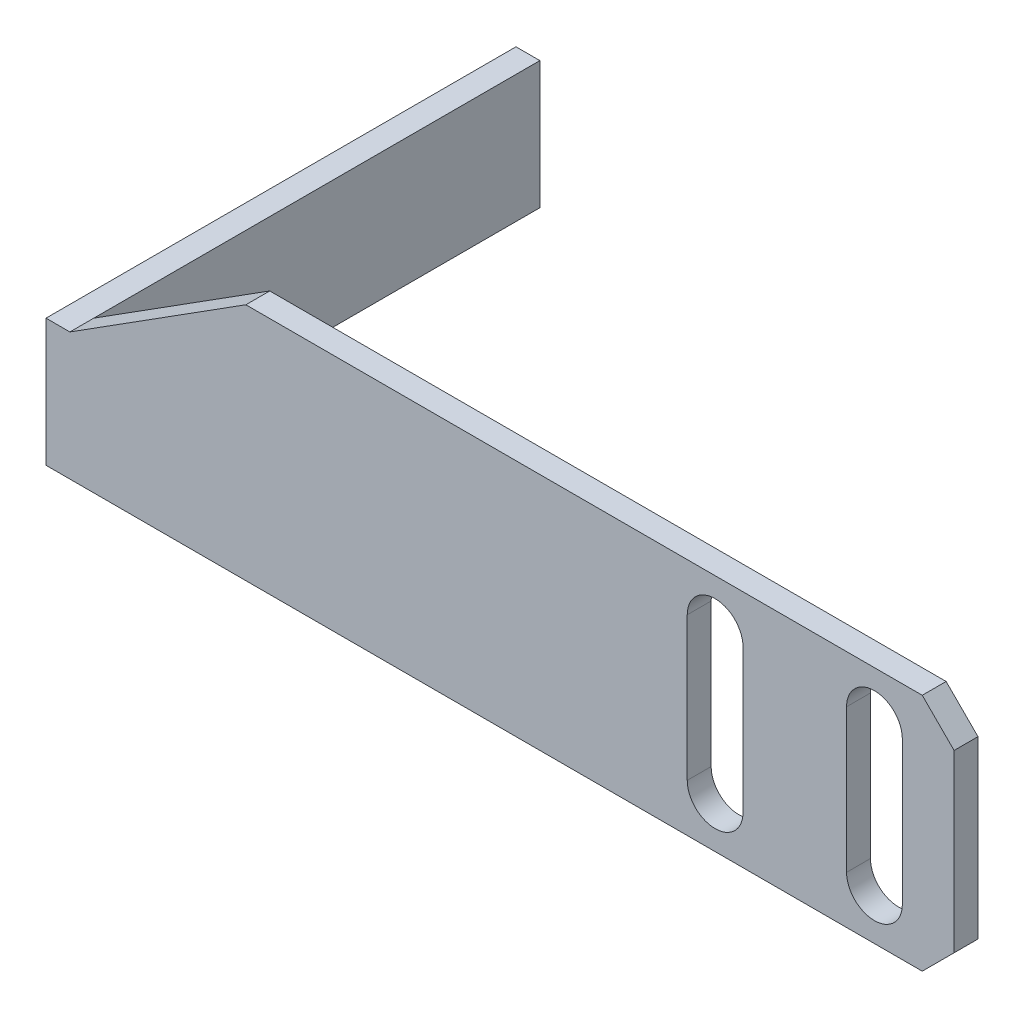
ISO-10303-21;
HEADER;
FILE_DESCRIPTION(('STEP AP214'),'2;1');
FILE_NAME('part.step','',(''),(''),'','','');
FILE_SCHEMA(('AUTOMOTIVE_DESIGN { 1 0 10303 214 1 1 1 1 }'));
ENDSEC;
DATA;
#1=APPLICATION_CONTEXT('core data for automotive mechanical design processes');
#2=APPLICATION_PROTOCOL_DEFINITION('international standard','automotive_design',2000,#1);
#3=PRODUCT_CONTEXT('',#1,'mechanical');
#4=PRODUCT('Part','Part','',(#3));
#5=PRODUCT_RELATED_PRODUCT_CATEGORY('part','',(#4));
#6=PRODUCT_DEFINITION_FORMATION('','',#4);
#7=PRODUCT_DEFINITION_CONTEXT('part definition',#1,'design');
#8=PRODUCT_DEFINITION('design','',#6,#7);
#9=PRODUCT_DEFINITION_SHAPE('','',#8);
#10=(LENGTH_UNIT() NAMED_UNIT(*) SI_UNIT(.MILLI.,.METRE.));
#11=(NAMED_UNIT(*) PLANE_ANGLE_UNIT() SI_UNIT($,.RADIAN.));
#12=(NAMED_UNIT(*) SI_UNIT($,.STERADIAN.) SOLID_ANGLE_UNIT());
#13=UNCERTAINTY_MEASURE_WITH_UNIT(LENGTH_MEASURE(1.E-05),#10,'distance_accuracy_value','');
#14=(GEOMETRIC_REPRESENTATION_CONTEXT(3) GLOBAL_UNCERTAINTY_ASSIGNED_CONTEXT((#13)) GLOBAL_UNIT_ASSIGNED_CONTEXT((#10,
#11,#12)) REPRESENTATION_CONTEXT('',''));
#15=CARTESIAN_POINT('',(0.,0.,0.));
#16=DIRECTION('',(0.,0.,1.));
#17=DIRECTION('',(1.,0.,0.));
#18=AXIS2_PLACEMENT_3D('',#15,#16,#17);
#19=CARTESIAN_POINT('',(-21.8181818181818,-18.75,1.5));
#20=DIRECTION('',(1.,0.,0.));
#21=DIRECTION('',(0.,0.,-1.));
#22=AXIS2_PLACEMENT_3D('',#19,#20,#21);
#23=PLANE('',#22);
#24=DIRECTION('',(0.,0.,-1.));
#25=VECTOR('',#24,1.);
#26=CARTESIAN_POINT('',(-21.8181818181818,-10.75,1.5));
#27=LINE('',#26,#25);
#28=CARTESIAN_POINT('',(-21.8181818181818,-10.75,1.5));
#29=VERTEX_POINT('',#28);
#30=CARTESIAN_POINT('',(-21.8181818181818,-10.75,-28.));
#31=VERTEX_POINT('',#30);
#32=EDGE_CURVE('E246',#29,#31,#27,.T.);
#33=ORIENTED_EDGE('',*,*,#32,.T.);
#34=DIRECTION('',(0.,1.,0.));
#35=VECTOR('',#34,1.);
#36=CARTESIAN_POINT('',(-21.8181818181818,-10.75,-28.));
#37=LINE('',#36,#35);
#38=CARTESIAN_POINT('',(-21.8181818181818,-18.75,-28.));
#39=VERTEX_POINT('',#38);
#40=EDGE_CURVE('E213',#39,#31,#37,.T.);
#41=ORIENTED_EDGE('',*,*,#40,.F.);
#42=DIRECTION('',(0.,0.,-1.));
#43=VECTOR('',#42,1.);
#44=CARTESIAN_POINT('',(-21.8181818181818,-18.75,1.5));
#45=LINE('',#44,#43);
#46=CARTESIAN_POINT('',(-21.8181818181818,-18.75,1.5));
#47=VERTEX_POINT('',#46);
#48=EDGE_CURVE('E262',#47,#39,#45,.T.);
#49=ORIENTED_EDGE('',*,*,#48,.F.);
#50=DIRECTION('',(0.,-1.,0.));
#51=VECTOR('',#50,1.);
#52=CARTESIAN_POINT('',(-21.8181818181818,-18.75,1.5));
#53=LINE('',#52,#51);
#54=EDGE_CURVE('E232',#29,#47,#53,.T.);
#55=ORIENTED_EDGE('',*,*,#54,.F.);
#56=EDGE_LOOP('',(#33,#41,#49,#55));
#57=FACE_BOUND('',#56,.T.);
#58=ADVANCED_FACE('F33',(#57),#23,.F.);
#59=CARTESIAN_POINT('',(-21.8181818181818,-18.75,1.5));
#60=DIRECTION('',(0.,1.,0.));
#61=DIRECTION('',(0.,0.,1.));
#62=AXIS2_PLACEMENT_3D('',#59,#60,#61);
#63=PLANE('',#62);
#64=DIRECTION('',(1.,0.,0.));
#65=VECTOR('',#64,1.);
#66=CARTESIAN_POINT('',(-21.8181818181818,-18.75,0.));
#67=LINE('',#66,#65);
#68=CARTESIAN_POINT('',(-20.3181818181818,-18.75,0.));
#69=VERTEX_POINT('',#68);
#70=CARTESIAN_POINT('',(33.1818181818182,-18.75,0.));
#71=VERTEX_POINT('',#70);
#72=EDGE_CURVE('E231',#69,#71,#67,.T.);
#73=ORIENTED_EDGE('',*,*,#72,.T.);
#74=DIRECTION('',(0.,0.,1.));
#75=VECTOR('',#74,1.);
#76=CARTESIAN_POINT('',(33.1818181818182,-18.75,1.5));
#77=LINE('',#76,#75);
#78=CARTESIAN_POINT('',(33.1818181818182,-18.75,1.5));
#79=VERTEX_POINT('',#78);
#80=EDGE_CURVE('E56',#71,#79,#77,.T.);
#81=ORIENTED_EDGE('',*,*,#80,.T.);
#82=DIRECTION('',(1.,0.,0.));
#83=VECTOR('',#82,1.);
#84=CARTESIAN_POINT('',(-21.8181818181818,-18.75,1.5));
#85=LINE('',#84,#83);
#86=EDGE_CURVE('E235',#47,#79,#85,.T.);
#87=ORIENTED_EDGE('',*,*,#86,.F.);
#88=ORIENTED_EDGE('',*,*,#48,.T.);
#89=DIRECTION('',(-1.,0.,0.));
#90=VECTOR('',#89,1.);
#91=CARTESIAN_POINT('',(-21.8181818181818,-18.75,-28.));
#92=LINE('',#91,#90);
#93=CARTESIAN_POINT('',(-20.3181818181818,-18.75,-28.));
#94=VERTEX_POINT('',#93);
#95=EDGE_CURVE('E220',#94,#39,#92,.T.);
#96=ORIENTED_EDGE('',*,*,#95,.F.);
#97=DIRECTION('',(0.,0.,1.));
#98=VECTOR('',#97,1.);
#99=CARTESIAN_POINT('',(-20.3181818181818,-18.75,-28.));
#100=LINE('',#99,#98);
#101=EDGE_CURVE('E223',#94,#69,#100,.T.);
#102=ORIENTED_EDGE('',*,*,#101,.T.);
#103=EDGE_LOOP('',(#73,#81,#87,#88,#96,#102));
#104=FACE_BOUND('',#103,.T.);
#105=ADVANCED_FACE('F301',(#104),#63,.F.);
#106=CARTESIAN_POINT('',(35.1818181818182,-18.75,1.5));
#107=DIRECTION('',(-1.,0.,0.));
#108=DIRECTION('',(0.,0.,1.));
#109=AXIS2_PLACEMENT_3D('',#106,#107,#108);
#110=PLANE('',#109);
#111=DIRECTION('',(0.,1.,0.));
#112=VECTOR('',#111,1.);
#113=CARTESIAN_POINT('',(35.1818181818182,-18.75,1.5));
#114=LINE('',#113,#112);
#115=CARTESIAN_POINT('',(35.1818181818182,-16.75,1.5));
#116=VERTEX_POINT('',#115);
#117=CARTESIAN_POINT('',(35.1818181818182,-5.75,1.5));
#118=VERTEX_POINT('',#117);
#119=EDGE_CURVE('E238',#116,#118,#114,.T.);
#120=ORIENTED_EDGE('',*,*,#119,.F.);
#121=DIRECTION('',(0.,0.,-1.));
#122=VECTOR('',#121,1.);
#123=CARTESIAN_POINT('',(35.1818181818182,-16.75,1.5));
#124=LINE('',#123,#122);
#125=CARTESIAN_POINT('',(35.1818181818182,-16.75,0.));
#126=VERTEX_POINT('',#125);
#127=EDGE_CURVE('E282',#116,#126,#124,.T.);
#128=ORIENTED_EDGE('',*,*,#127,.T.);
#129=DIRECTION('',(0.,1.,0.));
#130=VECTOR('',#129,1.);
#131=CARTESIAN_POINT('',(35.1818181818182,-18.75,0.));
#132=LINE('',#131,#130);
#133=CARTESIAN_POINT('',(35.1818181818182,-5.75,0.));
#134=VERTEX_POINT('',#133);
#135=EDGE_CURVE('E248',#126,#134,#132,.T.);
#136=ORIENTED_EDGE('',*,*,#135,.T.);
#137=DIRECTION('',(0.,0.,1.));
#138=VECTOR('',#137,1.);
#139=CARTESIAN_POINT('',(35.1818181818182,-5.75,1.5));
#140=LINE('',#139,#138);
#141=EDGE_CURVE('E280',#134,#118,#140,.T.);
#142=ORIENTED_EDGE('',*,*,#141,.T.);
#143=EDGE_LOOP('',(#120,#128,#136,#142));
#144=FACE_BOUND('',#143,.T.);
#145=ADVANCED_FACE('F295',(#144),#110,.F.);
#146=CARTESIAN_POINT('',(-9.27272727272727,-3.75,1.5));
#147=DIRECTION('',(0.,-1.,0.));
#148=DIRECTION('',(0.,0.,-1.));
#149=AXIS2_PLACEMENT_3D('',#146,#147,#148);
#150=PLANE('',#149);
#151=DIRECTION('',(-1.,0.,0.));
#152=VECTOR('',#151,1.);
#153=CARTESIAN_POINT('',(-9.27272727272727,-3.75,1.5));
#154=LINE('',#153,#152);
#155=CARTESIAN_POINT('',(33.1818181818182,-3.75,1.5));
#156=VERTEX_POINT('',#155);
#157=CARTESIAN_POINT('',(-9.27272727272727,-3.75,1.5));
#158=VERTEX_POINT('',#157);
#159=EDGE_CURVE('E240',#156,#158,#154,.T.);
#160=ORIENTED_EDGE('',*,*,#159,.F.);
#161=DIRECTION('',(0.,0.,-1.));
#162=VECTOR('',#161,1.);
#163=CARTESIAN_POINT('',(33.1818181818182,-3.75,1.5));
#164=LINE('',#163,#162);
#165=CARTESIAN_POINT('',(33.1818181818182,-3.75,0.));
#166=VERTEX_POINT('',#165);
#167=EDGE_CURVE('E11',#156,#166,#164,.T.);
#168=ORIENTED_EDGE('',*,*,#167,.T.);
#169=DIRECTION('',(-1.,0.,0.));
#170=VECTOR('',#169,1.);
#171=CARTESIAN_POINT('',(-9.27272727272727,-3.75,0.));
#172=LINE('',#171,#170);
#173=CARTESIAN_POINT('',(-9.27272727272727,-3.75,0.));
#174=VERTEX_POINT('',#173);
#175=EDGE_CURVE('E251',#166,#174,#172,.T.);
#176=ORIENTED_EDGE('',*,*,#175,.T.);
#177=DIRECTION('',(0.,0.,-1.));
#178=VECTOR('',#177,1.);
#179=CARTESIAN_POINT('',(-9.27272727272727,-3.75,1.5));
#180=LINE('',#179,#178);
#181=EDGE_CURVE('E259',#158,#174,#180,.T.);
#182=ORIENTED_EDGE('',*,*,#181,.F.);
#183=EDGE_LOOP('',(#160,#168,#176,#182));
#184=FACE_BOUND('',#183,.T.);
#185=ADVANCED_FACE('F324',(#184),#150,.F.);
#186=CARTESIAN_POINT('',(-20.3181818181818,-10.75,1.5));
#187=DIRECTION('',(0.535300145146239,-0.844661917341143,0.));
#188=DIRECTION('',(0.844661917341143,0.535300145146239,0.));
#189=AXIS2_PLACEMENT_3D('',#186,#187,#188);
#190=PLANE('',#189);
#191=DIRECTION('',(-0.844661917341143,-0.535300145146239,0.));
#192=VECTOR('',#191,1.);
#193=CARTESIAN_POINT('',(-20.3181818181818,-10.75,0.));
#194=LINE('',#193,#192);
#195=CARTESIAN_POINT('',(-20.3181818181818,-10.75,0.));
#196=VERTEX_POINT('',#195);
#197=EDGE_CURVE('E236',#174,#196,#194,.T.);
#198=ORIENTED_EDGE('',*,*,#197,.T.);
#199=DIRECTION('',(0.,0.,-1.));
#200=VECTOR('',#199,1.);
#201=CARTESIAN_POINT('',(-20.3181818181818,-10.75,1.5));
#202=LINE('',#201,#200);
#203=CARTESIAN_POINT('',(-20.3181818181818,-10.75,1.5));
#204=VERTEX_POINT('',#203);
#205=EDGE_CURVE('E256',#204,#196,#202,.T.);
#206=ORIENTED_EDGE('',*,*,#205,.F.);
#207=DIRECTION('',(-0.844661917341143,-0.535300145146239,0.));
#208=VECTOR('',#207,1.);
#209=CARTESIAN_POINT('',(-20.3181818181818,-10.75,1.5));
#210=LINE('',#209,#208);
#211=EDGE_CURVE('E242',#158,#204,#210,.T.);
#212=ORIENTED_EDGE('',*,*,#211,.F.);
#213=ORIENTED_EDGE('',*,*,#181,.T.);
#214=EDGE_LOOP('',(#198,#206,#212,#213));
#215=FACE_BOUND('',#214,.T.);
#216=ADVANCED_FACE('F312',(#215),#190,.F.);
#217=CARTESIAN_POINT('',(-21.8181818181818,-10.75,1.5));
#218=DIRECTION('',(0.,-1.,0.));
#219=DIRECTION('',(0.,0.,-1.));
#220=AXIS2_PLACEMENT_3D('',#217,#218,#219);
#221=PLANE('',#220);
#222=ORIENTED_EDGE('',*,*,#205,.T.);
#223=DIRECTION('',(0.,0.,1.));
#224=VECTOR('',#223,1.);
#225=CARTESIAN_POINT('',(-20.3181818181818,-10.75,-28.));
#226=LINE('',#225,#224);
#227=CARTESIAN_POINT('',(-20.3181818181818,-10.75,-28.));
#228=VERTEX_POINT('',#227);
#229=EDGE_CURVE('E228',#228,#196,#226,.T.);
#230=ORIENTED_EDGE('',*,*,#229,.F.);
#231=DIRECTION('',(1.,0.,0.));
#232=VECTOR('',#231,1.);
#233=CARTESIAN_POINT('',(-21.8181818181818,-10.75,-28.));
#234=LINE('',#233,#232);
#235=EDGE_CURVE('E216',#31,#228,#234,.T.);
#236=ORIENTED_EDGE('',*,*,#235,.F.);
#237=ORIENTED_EDGE('',*,*,#32,.F.);
#238=DIRECTION('',(-1.,0.,0.));
#239=VECTOR('',#238,1.);
#240=CARTESIAN_POINT('',(-21.8181818181818,-10.75,1.5));
#241=LINE('',#240,#239);
#242=EDGE_CURVE('E244',#204,#29,#241,.T.);
#243=ORIENTED_EDGE('',*,*,#242,.F.);
#244=EDGE_LOOP('',(#222,#230,#236,#237,#243));
#245=FACE_BOUND('',#244,.T.);
#246=ADVANCED_FACE('F317',(#245),#221,.F.);
#247=CARTESIAN_POINT('',(0.,0.,1.5));
#248=DIRECTION('',(0.,0.,-1.));
#249=DIRECTION('',(-1.,0.,0.));
#250=AXIS2_PLACEMENT_3D('',#247,#248,#249);
#251=PLANE('',#250);
#252=DIRECTION('',(0.,-1.,0.));
#253=VECTOR('',#252,1.);
#254=CARTESIAN_POINT('',(28.4318181818182,-6.75,1.5));
#255=LINE('',#254,#253);
#256=CARTESIAN_POINT('',(28.4318181818182,-6.75,1.5));
#257=VERTEX_POINT('',#256);
#258=CARTESIAN_POINT('',(28.4318181818182,-15.75,1.5));
#259=VERTEX_POINT('',#258);
#260=EDGE_CURVE('E173',#257,#259,#255,.T.);
#261=ORIENTED_EDGE('',*,*,#260,.F.);
#262=CARTESIAN_POINT('',(30.1818181818182,-6.75,1.5));
#263=DIRECTION('',(0.,0.,1.));
#264=DIRECTION('',(1.,0.,0.));
#265=AXIS2_PLACEMENT_3D('',#262,#263,#264);
#266=CIRCLE('',#265,1.75);
#267=CARTESIAN_POINT('',(31.9318181818182,-6.75,1.5));
#268=VERTEX_POINT('',#267);
#269=EDGE_CURVE('E178',#268,#257,#266,.T.);
#270=ORIENTED_EDGE('',*,*,#269,.F.);
#271=DIRECTION('',(0.,1.,0.));
#272=VECTOR('',#271,1.);
#273=CARTESIAN_POINT('',(31.9318181818182,-6.75,1.5));
#274=LINE('',#273,#272);
#275=CARTESIAN_POINT('',(31.9318181818182,-15.75,1.5));
#276=VERTEX_POINT('',#275);
#277=EDGE_CURVE('E183',#276,#268,#274,.T.);
#278=ORIENTED_EDGE('',*,*,#277,.F.);
#279=CARTESIAN_POINT('',(30.1818181818182,-15.75,1.5));
#280=DIRECTION('',(0.,0.,1.));
#281=DIRECTION('',(1.,0.,0.));
#282=AXIS2_PLACEMENT_3D('',#279,#280,#281);
#283=CIRCLE('',#282,1.74999999999999);
#284=EDGE_CURVE('E162',#259,#276,#283,.T.);
#285=ORIENTED_EDGE('',*,*,#284,.F.);
#286=EDGE_LOOP('',(#261,#270,#278,#285));
#287=FACE_BOUND('',#286,.T.);
#288=DIRECTION('',(0.,-1.,0.));
#289=VECTOR('',#288,1.);
#290=CARTESIAN_POINT('',(18.4318181818182,-6.75,1.5));
#291=LINE('',#290,#289);
#292=CARTESIAN_POINT('',(18.4318181818182,-6.75,1.5));
#293=VERTEX_POINT('',#292);
#294=CARTESIAN_POINT('',(18.4318181818182,-15.75,1.5));
#295=VERTEX_POINT('',#294);
#296=EDGE_CURVE('E194',#293,#295,#291,.T.);
#297=ORIENTED_EDGE('',*,*,#296,.F.);
#298=CARTESIAN_POINT('',(20.1818181818182,-6.75,1.5));
#299=DIRECTION('',(0.,0.,1.));
#300=DIRECTION('',(1.,0.,0.));
#301=AXIS2_PLACEMENT_3D('',#298,#299,#300);
#302=CIRCLE('',#301,1.75);
#303=CARTESIAN_POINT('',(21.9318181818182,-6.75,1.5));
#304=VERTEX_POINT('',#303);
#305=EDGE_CURVE('E190',#304,#293,#302,.T.);
#306=ORIENTED_EDGE('',*,*,#305,.F.);
#307=DIRECTION('',(0.,1.,0.));
#308=VECTOR('',#307,1.);
#309=CARTESIAN_POINT('',(21.9318181818182,-6.75,1.5));
#310=LINE('',#309,#308);
#311=CARTESIAN_POINT('',(21.9318181818182,-15.75,1.5));
#312=VERTEX_POINT('',#311);
#313=EDGE_CURVE('E200',#312,#304,#310,.T.);
#314=ORIENTED_EDGE('',*,*,#313,.F.);
#315=CARTESIAN_POINT('',(20.1818181818182,-15.75,1.5));
#316=DIRECTION('',(0.,0.,1.));
#317=DIRECTION('',(1.,0.,0.));
#318=AXIS2_PLACEMENT_3D('',#315,#316,#317);
#319=CIRCLE('',#318,1.75);
#320=EDGE_CURVE('E197',#295,#312,#319,.T.);
#321=ORIENTED_EDGE('',*,*,#320,.F.);
#322=EDGE_LOOP('',(#297,#306,#314,#321));
#323=FACE_BOUND('',#322,.T.);
#324=ORIENTED_EDGE('',*,*,#86,.T.);
#325=DIRECTION('',(-0.707106781186549,-0.707106781186546,0.));
#326=VECTOR('',#325,1.);
#327=CARTESIAN_POINT('',(35.1818181818182,-16.75,1.5));
#328=LINE('',#327,#326);
#329=EDGE_CURVE('E41',#79,#116,#328,.F.);
#330=ORIENTED_EDGE('',*,*,#329,.T.);
#331=ORIENTED_EDGE('',*,*,#119,.T.);
#332=DIRECTION('',(0.707106781186548,-0.707106781186548,0.));
#333=VECTOR('',#332,1.);
#334=CARTESIAN_POINT('',(33.1818181818182,-3.75,1.5));
#335=LINE('',#334,#333);
#336=EDGE_CURVE('E48',#118,#156,#335,.F.);
#337=ORIENTED_EDGE('',*,*,#336,.T.);
#338=ORIENTED_EDGE('',*,*,#159,.T.);
#339=ORIENTED_EDGE('',*,*,#211,.T.);
#340=ORIENTED_EDGE('',*,*,#242,.T.);
#341=ORIENTED_EDGE('',*,*,#54,.T.);
#342=EDGE_LOOP('',(#324,#330,#331,#337,#338,#339,#340,#341));
#343=FACE_BOUND('',#342,.T.);
#344=ADVANCED_FACE('F180',(#287,#323,#343),#251,.F.);
#345=CARTESIAN_POINT('',(0.,0.,0.));
#346=DIRECTION('',(0.,0.,-1.));
#347=DIRECTION('',(-1.,0.,0.));
#348=AXIS2_PLACEMENT_3D('',#345,#346,#347);
#349=PLANE('',#348);
#350=CARTESIAN_POINT('',(30.1818181818182,-6.75,0.));
#351=DIRECTION('',(0.,0.,-1.));
#352=DIRECTION('',(-1.,0.,0.));
#353=AXIS2_PLACEMENT_3D('',#350,#351,#352);
#354=CIRCLE('',#353,1.75);
#355=CARTESIAN_POINT('',(28.4318181818182,-6.75,0.));
#356=VERTEX_POINT('',#355);
#357=CARTESIAN_POINT('',(31.9318181818182,-6.75,0.));
#358=VERTEX_POINT('',#357);
#359=EDGE_CURVE('E278',#356,#358,#354,.T.);
#360=ORIENTED_EDGE('',*,*,#359,.F.);
#361=DIRECTION('',(0.,1.,0.));
#362=VECTOR('',#361,1.);
#363=CARTESIAN_POINT('',(28.4318181818182,0.,0.));
#364=LINE('',#363,#362);
#365=CARTESIAN_POINT('',(28.4318181818182,-15.75,0.));
#366=VERTEX_POINT('',#365);
#367=EDGE_CURVE('E273',#366,#356,#364,.T.);
#368=ORIENTED_EDGE('',*,*,#367,.F.);
#369=CARTESIAN_POINT('',(30.1818181818182,-15.75,0.));
#370=DIRECTION('',(0.,0.,-1.));
#371=DIRECTION('',(-1.,0.,0.));
#372=AXIS2_PLACEMENT_3D('',#369,#370,#371);
#373=CIRCLE('',#372,1.74999999999999);
#374=CARTESIAN_POINT('',(31.9318181818182,-15.75,0.));
#375=VERTEX_POINT('',#374);
#376=EDGE_CURVE('E165',#375,#366,#373,.T.);
#377=ORIENTED_EDGE('',*,*,#376,.F.);
#378=DIRECTION('',(0.,-1.,0.));
#379=VECTOR('',#378,1.);
#380=CARTESIAN_POINT('',(31.9318181818182,0.,0.));
#381=LINE('',#380,#379);
#382=EDGE_CURVE('E276',#358,#375,#381,.T.);
#383=ORIENTED_EDGE('',*,*,#382,.F.);
#384=EDGE_LOOP('',(#360,#368,#377,#383));
#385=FACE_BOUND('',#384,.T.);
#386=CARTESIAN_POINT('',(20.1818181818182,-6.75,0.));
#387=DIRECTION('',(0.,0.,-1.));
#388=DIRECTION('',(-1.,0.,0.));
#389=AXIS2_PLACEMENT_3D('',#386,#387,#388);
#390=CIRCLE('',#389,1.75);
#391=CARTESIAN_POINT('',(18.4318181818182,-6.75,0.));
#392=VERTEX_POINT('',#391);
#393=CARTESIAN_POINT('',(21.9318181818182,-6.75,0.));
#394=VERTEX_POINT('',#393);
#395=EDGE_CURVE('E271',#392,#394,#390,.T.);
#396=ORIENTED_EDGE('',*,*,#395,.F.);
#397=DIRECTION('',(0.,1.,0.));
#398=VECTOR('',#397,1.);
#399=CARTESIAN_POINT('',(18.4318181818182,0.,0.));
#400=LINE('',#399,#398);
#401=CARTESIAN_POINT('',(18.4318181818182,-15.75,0.));
#402=VERTEX_POINT('',#401);
#403=EDGE_CURVE('E264',#402,#392,#400,.T.);
#404=ORIENTED_EDGE('',*,*,#403,.F.);
#405=CARTESIAN_POINT('',(20.1818181818182,-15.75,0.));
#406=DIRECTION('',(0.,0.,-1.));
#407=DIRECTION('',(-1.,0.,0.));
#408=AXIS2_PLACEMENT_3D('',#405,#406,#407);
#409=CIRCLE('',#408,1.75);
#410=CARTESIAN_POINT('',(21.9318181818182,-15.75,0.));
#411=VERTEX_POINT('',#410);
#412=EDGE_CURVE('E266',#411,#402,#409,.T.);
#413=ORIENTED_EDGE('',*,*,#412,.F.);
#414=DIRECTION('',(0.,-1.,0.));
#415=VECTOR('',#414,1.);
#416=CARTESIAN_POINT('',(21.9318181818182,0.,0.));
#417=LINE('',#416,#415);
#418=EDGE_CURVE('E269',#394,#411,#417,.T.);
#419=ORIENTED_EDGE('',*,*,#418,.F.);
#420=EDGE_LOOP('',(#396,#404,#413,#419));
#421=FACE_BOUND('',#420,.T.);
#422=ORIENTED_EDGE('',*,*,#135,.F.);
#423=DIRECTION('',(0.707106781186549,0.707106781186546,0.));
#424=VECTOR('',#423,1.);
#425=CARTESIAN_POINT('',(25.965909090909,-25.9659090909091,0.));
#426=LINE('',#425,#424);
#427=EDGE_CURVE('E287',#126,#71,#426,.F.);
#428=ORIENTED_EDGE('',*,*,#427,.T.);
#429=ORIENTED_EDGE('',*,*,#72,.F.);
#430=DIRECTION('',(0.,-1.,0.));
#431=VECTOR('',#430,1.);
#432=CARTESIAN_POINT('',(-20.3181818181818,-10.75,0.));
#433=LINE('',#432,#431);
#434=EDGE_CURVE('E206',#196,#69,#433,.T.);
#435=ORIENTED_EDGE('',*,*,#434,.F.);
#436=ORIENTED_EDGE('',*,*,#197,.F.);
#437=ORIENTED_EDGE('',*,*,#175,.F.);
#438=DIRECTION('',(-0.707106781186548,0.707106781186548,0.));
#439=VECTOR('',#438,1.);
#440=CARTESIAN_POINT('',(14.7159090909091,14.7159090909091,0.));
#441=LINE('',#440,#439);
#442=EDGE_CURVE('E285',#166,#134,#441,.F.);
#443=ORIENTED_EDGE('',*,*,#442,.T.);
#444=EDGE_LOOP('',(#422,#428,#429,#435,#436,#437,#443));
#445=FACE_BOUND('',#444,.T.);
#446=ADVANCED_FACE('F300',(#385,#421,#445),#349,.T.);
#447=CARTESIAN_POINT('',(-20.3181818181818,-10.75,-28.));
#448=DIRECTION('',(-1.,0.,0.));
#449=DIRECTION('',(0.,0.,1.));
#450=AXIS2_PLACEMENT_3D('',#447,#448,#449);
#451=PLANE('',#450);
#452=ORIENTED_EDGE('',*,*,#434,.T.);
#453=ORIENTED_EDGE('',*,*,#101,.F.);
#454=DIRECTION('',(0.,-1.,0.));
#455=VECTOR('',#454,1.);
#456=CARTESIAN_POINT('',(-20.3181818181818,-10.75,-28.));
#457=LINE('',#456,#455);
#458=EDGE_CURVE('E218',#228,#94,#457,.T.);
#459=ORIENTED_EDGE('',*,*,#458,.F.);
#460=ORIENTED_EDGE('',*,*,#229,.T.);
#461=EDGE_LOOP('',(#452,#453,#459,#460));
#462=FACE_BOUND('',#461,.T.);
#463=ADVANCED_FACE('F306',(#462),#451,.F.);
#464=CARTESIAN_POINT('',(0.,0.,-28.));
#465=DIRECTION('',(0.,0.,1.));
#466=DIRECTION('',(1.,0.,0.));
#467=AXIS2_PLACEMENT_3D('',#464,#465,#466);
#468=PLANE('',#467);
#469=ORIENTED_EDGE('',*,*,#40,.T.);
#470=ORIENTED_EDGE('',*,*,#235,.T.);
#471=ORIENTED_EDGE('',*,*,#458,.T.);
#472=ORIENTED_EDGE('',*,*,#95,.T.);
#473=EDGE_LOOP('',(#469,#470,#471,#472));
#474=FACE_BOUND('',#473,.T.);
#475=ADVANCED_FACE('F353',(#474),#468,.F.);
#476=CARTESIAN_POINT('',(20.1818181818182,-6.75,-26.5));
#477=DIRECTION('',(0.,0.,1.));
#478=DIRECTION('',(1.,0.,0.));
#479=AXIS2_PLACEMENT_3D('',#476,#477,#478);
#480=CYLINDRICAL_SURFACE('',#479,1.75);
#481=ORIENTED_EDGE('',*,*,#395,.T.);
#482=DIRECTION('',(0.,0.,1.));
#483=VECTOR('',#482,1.);
#484=CARTESIAN_POINT('',(21.9318181818182,-6.75,-26.5));
#485=LINE('',#484,#483);
#486=EDGE_CURVE('E204',#394,#304,#485,.T.);
#487=ORIENTED_EDGE('',*,*,#486,.T.);
#488=ORIENTED_EDGE('',*,*,#305,.T.);
#489=DIRECTION('',(0.,0.,1.));
#490=VECTOR('',#489,1.);
#491=CARTESIAN_POINT('',(18.4318181818182,-6.75,-26.5));
#492=LINE('',#491,#490);
#493=EDGE_CURVE('E203',#392,#293,#492,.T.);
#494=ORIENTED_EDGE('',*,*,#493,.F.);
#495=EDGE_LOOP('',(#481,#487,#488,#494));
#496=FACE_BOUND('',#495,.T.);
#497=ADVANCED_FACE('F356',(#496),#480,.F.);
#498=CARTESIAN_POINT('',(21.9318181818182,-6.75,-26.5));
#499=DIRECTION('',(1.,0.,0.));
#500=DIRECTION('',(0.,1.,0.));
#501=AXIS2_PLACEMENT_3D('',#498,#499,#500);
#502=PLANE('',#501);
#503=ORIENTED_EDGE('',*,*,#418,.T.);
#504=DIRECTION('',(0.,0.,1.));
#505=VECTOR('',#504,1.);
#506=CARTESIAN_POINT('',(21.9318181818182,-15.75,-26.5));
#507=LINE('',#506,#505);
#508=EDGE_CURVE('E207',#411,#312,#507,.T.);
#509=ORIENTED_EDGE('',*,*,#508,.T.);
#510=ORIENTED_EDGE('',*,*,#313,.T.);
#511=ORIENTED_EDGE('',*,*,#486,.F.);
#512=EDGE_LOOP('',(#503,#509,#510,#511));
#513=FACE_BOUND('',#512,.T.);
#514=ADVANCED_FACE('F360',(#513),#502,.F.);
#515=CARTESIAN_POINT('',(20.1818181818182,-15.75,-26.5));
#516=DIRECTION('',(0.,0.,1.));
#517=DIRECTION('',(1.,0.,0.));
#518=AXIS2_PLACEMENT_3D('',#515,#516,#517);
#519=CYLINDRICAL_SURFACE('',#518,1.75);
#520=ORIENTED_EDGE('',*,*,#412,.T.);
#521=DIRECTION('',(0.,0.,1.));
#522=VECTOR('',#521,1.);
#523=CARTESIAN_POINT('',(18.4318181818182,-15.75,-26.5));
#524=LINE('',#523,#522);
#525=EDGE_CURVE('E209',#402,#295,#524,.T.);
#526=ORIENTED_EDGE('',*,*,#525,.T.);
#527=ORIENTED_EDGE('',*,*,#320,.T.);
#528=ORIENTED_EDGE('',*,*,#508,.F.);
#529=EDGE_LOOP('',(#520,#526,#527,#528));
#530=FACE_BOUND('',#529,.T.);
#531=ADVANCED_FACE('F366',(#530),#519,.F.);
#532=CARTESIAN_POINT('',(18.4318181818182,-6.75,-26.5));
#533=DIRECTION('',(-1.,0.,0.));
#534=DIRECTION('',(0.,-1.,0.));
#535=AXIS2_PLACEMENT_3D('',#532,#533,#534);
#536=PLANE('',#535);
#537=ORIENTED_EDGE('',*,*,#403,.T.);
#538=ORIENTED_EDGE('',*,*,#493,.T.);
#539=ORIENTED_EDGE('',*,*,#296,.T.);
#540=ORIENTED_EDGE('',*,*,#525,.F.);
#541=EDGE_LOOP('',(#537,#538,#539,#540));
#542=FACE_BOUND('',#541,.T.);
#543=ADVANCED_FACE('F362',(#542),#536,.F.);
#544=CARTESIAN_POINT('',(30.1818181818182,-6.75,-26.5));
#545=DIRECTION('',(0.,0.,1.));
#546=DIRECTION('',(1.,0.,0.));
#547=AXIS2_PLACEMENT_3D('',#544,#545,#546);
#548=CYLINDRICAL_SURFACE('',#547,1.75);
#549=ORIENTED_EDGE('',*,*,#359,.T.);
#550=DIRECTION('',(0.,0.,1.));
#551=VECTOR('',#550,1.);
#552=CARTESIAN_POINT('',(31.9318181818182,-6.75,-26.5));
#553=LINE('',#552,#551);
#554=EDGE_CURVE('E188',#358,#268,#553,.T.);
#555=ORIENTED_EDGE('',*,*,#554,.T.);
#556=ORIENTED_EDGE('',*,*,#269,.T.);
#557=DIRECTION('',(0.,0.,1.));
#558=VECTOR('',#557,1.);
#559=CARTESIAN_POINT('',(28.4318181818182,-6.75,-26.5));
#560=LINE('',#559,#558);
#561=EDGE_CURVE('E169',#356,#257,#560,.T.);
#562=ORIENTED_EDGE('',*,*,#561,.F.);
#563=EDGE_LOOP('',(#549,#555,#556,#562));
#564=FACE_BOUND('',#563,.T.);
#565=ADVANCED_FACE('F365',(#564),#548,.F.);
#566=CARTESIAN_POINT('',(31.9318181818182,-6.75,-26.5));
#567=DIRECTION('',(1.,0.,0.));
#568=DIRECTION('',(0.,1.,0.));
#569=AXIS2_PLACEMENT_3D('',#566,#567,#568);
#570=PLANE('',#569);
#571=ORIENTED_EDGE('',*,*,#382,.T.);
#572=DIRECTION('',(0.,0.,1.));
#573=VECTOR('',#572,1.);
#574=CARTESIAN_POINT('',(31.9318181818182,-15.75,-26.5));
#575=LINE('',#574,#573);
#576=EDGE_CURVE('E168',#375,#276,#575,.T.);
#577=ORIENTED_EDGE('',*,*,#576,.T.);
#578=ORIENTED_EDGE('',*,*,#277,.T.);
#579=ORIENTED_EDGE('',*,*,#554,.F.);
#580=EDGE_LOOP('',(#571,#577,#578,#579));
#581=FACE_BOUND('',#580,.T.);
#582=ADVANCED_FACE('F376',(#581),#570,.F.);
#583=CARTESIAN_POINT('',(30.1818181818182,-15.75,-26.5));
#584=DIRECTION('',(0.,0.,1.));
#585=DIRECTION('',(1.,0.,0.));
#586=AXIS2_PLACEMENT_3D('',#583,#584,#585);
#587=CYLINDRICAL_SURFACE('',#586,1.74999999999999);
#588=ORIENTED_EDGE('',*,*,#376,.T.);
#589=DIRECTION('',(0.,0.,1.));
#590=VECTOR('',#589,1.);
#591=CARTESIAN_POINT('',(28.4318181818182,-15.75,-26.5));
#592=LINE('',#591,#590);
#593=EDGE_CURVE('E157',#366,#259,#592,.T.);
#594=ORIENTED_EDGE('',*,*,#593,.T.);
#595=ORIENTED_EDGE('',*,*,#284,.T.);
#596=ORIENTED_EDGE('',*,*,#576,.F.);
#597=EDGE_LOOP('',(#588,#594,#595,#596));
#598=FACE_BOUND('',#597,.T.);
#599=ADVANCED_FACE('F159',(#598),#587,.F.);
#600=CARTESIAN_POINT('',(28.4318181818182,-6.75,-26.5));
#601=DIRECTION('',(-1.,0.,0.));
#602=DIRECTION('',(0.,-1.,0.));
#603=AXIS2_PLACEMENT_3D('',#600,#601,#602);
#604=PLANE('',#603);
#605=ORIENTED_EDGE('',*,*,#367,.T.);
#606=ORIENTED_EDGE('',*,*,#561,.T.);
#607=ORIENTED_EDGE('',*,*,#260,.T.);
#608=ORIENTED_EDGE('',*,*,#593,.F.);
#609=EDGE_LOOP('',(#605,#606,#607,#608));
#610=FACE_BOUND('',#609,.T.);
#611=ADVANCED_FACE('F174',(#610),#604,.F.);
#612=CARTESIAN_POINT('',(35.1818181818182,-16.75,1.5));
#613=DIRECTION('',(-0.707106781186546,0.707106781186549,0.));
#614=DIRECTION('',(0.,0.,-1.));
#615=AXIS2_PLACEMENT_3D('',#612,#613,#614);
#616=PLANE('',#615);
#617=ORIENTED_EDGE('',*,*,#329,.F.);
#618=ORIENTED_EDGE('',*,*,#80,.F.);
#619=ORIENTED_EDGE('',*,*,#427,.F.);
#620=ORIENTED_EDGE('',*,*,#127,.F.);
#621=EDGE_LOOP('',(#617,#618,#619,#620));
#622=FACE_BOUND('',#621,.T.);
#623=ADVANCED_FACE('F298',(#622),#616,.F.);
#624=CARTESIAN_POINT('',(33.1818181818182,-3.75,1.5));
#625=DIRECTION('',(-0.707106781186547,-0.707106781186547,0.));
#626=DIRECTION('',(0.,0.,-1.));
#627=AXIS2_PLACEMENT_3D('',#624,#625,#626);
#628=PLANE('',#627);
#629=ORIENTED_EDGE('',*,*,#336,.F.);
#630=ORIENTED_EDGE('',*,*,#141,.F.);
#631=ORIENTED_EDGE('',*,*,#442,.F.);
#632=ORIENTED_EDGE('',*,*,#167,.F.);
#633=EDGE_LOOP('',(#629,#630,#631,#632));
#634=FACE_BOUND('',#633,.T.);
#635=ADVANCED_FACE('F35',(#634),#628,.F.);
#636=CLOSED_SHELL('',(#58,#105,#145,#185,#216,#246,#344,#446,#463,#475,#497,#514,#531,#543,#565,
#582,#599,#611,#623,#635));
#637=MANIFOLD_SOLID_BREP('B2',#636);
#638=ADVANCED_BREP_SHAPE_REPRESENTATION('',(#18,#637),#14);
#639=SHAPE_DEFINITION_REPRESENTATION(#9,#638);
ENDSEC;
END-ISO-10303-21;
